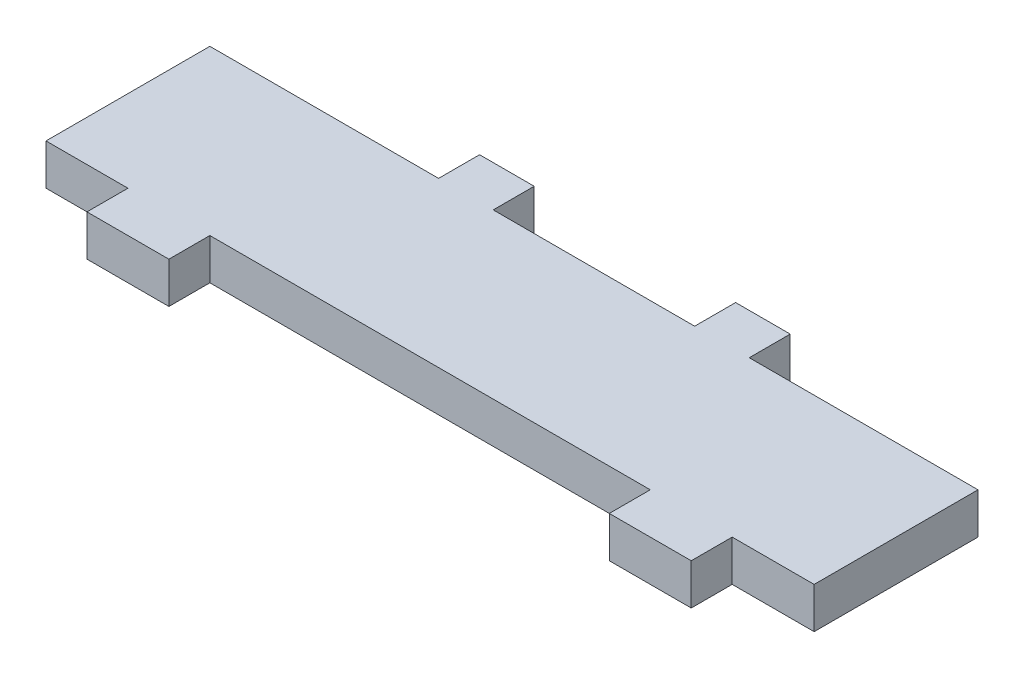
ISO-10303-21;
HEADER;
FILE_DESCRIPTION(('STEP AP214'),'2;1');
FILE_NAME('part.step','',(''),(''),'','','');
FILE_SCHEMA(('AUTOMOTIVE_DESIGN { 1 0 10303 214 1 1 1 1 }'));
ENDSEC;
DATA;
#1=APPLICATION_CONTEXT('core data for automotive mechanical design processes');
#2=APPLICATION_PROTOCOL_DEFINITION('international standard','automotive_design',2000,#1);
#3=PRODUCT_CONTEXT('',#1,'mechanical');
#4=PRODUCT('Part','Part','',(#3));
#5=PRODUCT_RELATED_PRODUCT_CATEGORY('part','',(#4));
#6=PRODUCT_DEFINITION_FORMATION('','',#4);
#7=PRODUCT_DEFINITION_CONTEXT('part definition',#1,'design');
#8=PRODUCT_DEFINITION('design','',#6,#7);
#9=PRODUCT_DEFINITION_SHAPE('','',#8);
#10=(LENGTH_UNIT() NAMED_UNIT(*) SI_UNIT(.MILLI.,.METRE.));
#11=(NAMED_UNIT(*) PLANE_ANGLE_UNIT() SI_UNIT($,.RADIAN.));
#12=(NAMED_UNIT(*) SI_UNIT($,.STERADIAN.) SOLID_ANGLE_UNIT());
#13=UNCERTAINTY_MEASURE_WITH_UNIT(LENGTH_MEASURE(1.E-05),#10,'distance_accuracy_value','');
#14=(GEOMETRIC_REPRESENTATION_CONTEXT(3) GLOBAL_UNCERTAINTY_ASSIGNED_CONTEXT((#13)) GLOBAL_UNIT_ASSIGNED_CONTEXT((#10,
#11,#12)) REPRESENTATION_CONTEXT('',''));
#15=CARTESIAN_POINT('',(0.,0.,0.));
#16=DIRECTION('',(0.,0.,1.));
#17=DIRECTION('',(1.,0.,0.));
#18=AXIS2_PLACEMENT_3D('',#15,#16,#17);
#19=CARTESIAN_POINT('',(-56.25,6.,12.));
#20=DIRECTION('',(0.,0.,-1.));
#21=DIRECTION('',(-1.,0.,0.));
#22=AXIS2_PLACEMENT_3D('',#19,#20,#21);
#23=PLANE('',#22);
#24=DIRECTION('',(0.,1.,0.));
#25=VECTOR('',#24,1.);
#26=CARTESIAN_POINT('',(44.25,0.,12.));
#27=LINE('',#26,#25);
#28=CARTESIAN_POINT('',(44.25,0.,12.));
#29=VERTEX_POINT('',#28);
#30=CARTESIAN_POINT('',(44.25,6.,12.));
#31=VERTEX_POINT('',#30);
#32=EDGE_CURVE('E353',#29,#31,#27,.T.);
#33=ORIENTED_EDGE('',*,*,#32,.F.);
#34=DIRECTION('',(1.,0.,0.));
#35=VECTOR('',#34,1.);
#36=CARTESIAN_POINT('',(-56.25,0.,12.));
#37=LINE('',#36,#35);
#38=CARTESIAN_POINT('',(56.25,0.,12.));
#39=VERTEX_POINT('',#38);
#40=EDGE_CURVE('E201',#29,#39,#37,.T.);
#41=ORIENTED_EDGE('',*,*,#40,.T.);
#42=DIRECTION('',(0.,-1.,0.));
#43=VECTOR('',#42,1.);
#44=CARTESIAN_POINT('',(56.25,6.,12.));
#45=LINE('',#44,#43);
#46=CARTESIAN_POINT('',(56.25,6.,12.));
#47=VERTEX_POINT('',#46);
#48=EDGE_CURVE('E301',#47,#39,#45,.T.);
#49=ORIENTED_EDGE('',*,*,#48,.F.);
#50=DIRECTION('',(1.,0.,0.));
#51=VECTOR('',#50,1.);
#52=CARTESIAN_POINT('',(-56.25,6.,12.));
#53=LINE('',#52,#51);
#54=EDGE_CURVE('E56',#31,#47,#53,.T.);
#55=ORIENTED_EDGE('',*,*,#54,.F.);
#56=EDGE_LOOP('',(#33,#41,#49,#55));
#57=FACE_BOUND('',#56,.T.);
#58=ADVANCED_FACE('F41',(#57),#23,.F.);
#59=CARTESIAN_POINT('',(-32.25,0.,12.));
#60=VERTEX_POINT('',#59);
#61=CARTESIAN_POINT('',(32.25,0.,12.));
#62=VERTEX_POINT('',#61);
#63=EDGE_CURVE('E312',#60,#62,#37,.T.);
#64=ORIENTED_EDGE('',*,*,#63,.T.);
#65=DIRECTION('',(0.,1.,0.));
#66=VECTOR('',#65,1.);
#67=CARTESIAN_POINT('',(32.25,0.,12.));
#68=LINE('',#67,#66);
#69=CARTESIAN_POINT('',(32.25,6.,12.));
#70=VERTEX_POINT('',#69);
#71=EDGE_CURVE('E64',#62,#70,#68,.T.);
#72=ORIENTED_EDGE('',*,*,#71,.T.);
#73=CARTESIAN_POINT('',(-32.25,6.,12.));
#74=VERTEX_POINT('',#73);
#75=EDGE_CURVE('E302',#74,#70,#53,.T.);
#76=ORIENTED_EDGE('',*,*,#75,.F.);
#77=DIRECTION('',(0.,1.,0.));
#78=VECTOR('',#77,1.);
#79=CARTESIAN_POINT('',(-32.25,0.,12.));
#80=LINE('',#79,#78);
#81=EDGE_CURVE('E204',#60,#74,#80,.T.);
#82=ORIENTED_EDGE('',*,*,#81,.F.);
#83=EDGE_LOOP('',(#64,#72,#76,#82));
#84=FACE_BOUND('',#83,.T.);
#85=ADVANCED_FACE('F350',(#84),#23,.F.);
#86=CARTESIAN_POINT('',(-56.25,6.,-12.));
#87=DIRECTION('',(0.,0.,1.));
#88=DIRECTION('',(1.,0.,0.));
#89=AXIS2_PLACEMENT_3D('',#86,#87,#88);
#90=PLANE('',#89);
#91=DIRECTION('',(0.,1.,0.));
#92=VECTOR('',#91,1.);
#93=CARTESIAN_POINT('',(-22.75,0.,-12.));
#94=LINE('',#93,#92);
#95=CARTESIAN_POINT('',(-22.75,0.,-12.));
#96=VERTEX_POINT('',#95);
#97=CARTESIAN_POINT('',(-22.75,6.,-12.));
#98=VERTEX_POINT('',#97);
#99=EDGE_CURVE('E238',#96,#98,#94,.T.);
#100=ORIENTED_EDGE('',*,*,#99,.F.);
#101=DIRECTION('',(-1.,0.,0.));
#102=VECTOR('',#101,1.);
#103=CARTESIAN_POINT('',(-56.25,0.,-12.));
#104=LINE('',#103,#102);
#105=CARTESIAN_POINT('',(-56.25,0.,-12.));
#106=VERTEX_POINT('',#105);
#107=EDGE_CURVE('E305',#96,#106,#104,.T.);
#108=ORIENTED_EDGE('',*,*,#107,.T.);
#109=DIRECTION('',(0.,-1.,0.));
#110=VECTOR('',#109,1.);
#111=CARTESIAN_POINT('',(-56.25,6.,-12.));
#112=LINE('',#111,#110);
#113=CARTESIAN_POINT('',(-56.25,6.,-12.));
#114=VERTEX_POINT('',#113);
#115=EDGE_CURVE('E49',#114,#106,#112,.T.);
#116=ORIENTED_EDGE('',*,*,#115,.F.);
#117=DIRECTION('',(-1.,0.,0.));
#118=VECTOR('',#117,1.);
#119=CARTESIAN_POINT('',(-56.25,6.,-12.));
#120=LINE('',#119,#118);
#121=EDGE_CURVE('E290',#98,#114,#120,.T.);
#122=ORIENTED_EDGE('',*,*,#121,.F.);
#123=EDGE_LOOP('',(#100,#108,#116,#122));
#124=FACE_BOUND('',#123,.T.);
#125=ADVANCED_FACE('F382',(#124),#90,.F.);
#126=DIRECTION('',(0.,-1.,0.));
#127=VECTOR('',#126,1.);
#128=CARTESIAN_POINT('',(22.75,0.,-12.));
#129=LINE('',#128,#127);
#130=CARTESIAN_POINT('',(22.75,6.,-12.));
#131=VERTEX_POINT('',#130);
#132=CARTESIAN_POINT('',(22.75,0.,-12.));
#133=VERTEX_POINT('',#132);
#134=EDGE_CURVE('E259',#131,#133,#129,.T.);
#135=ORIENTED_EDGE('',*,*,#134,.F.);
#136=CARTESIAN_POINT('',(56.25,6.,-12.));
#137=VERTEX_POINT('',#136);
#138=EDGE_CURVE('E292',#137,#131,#120,.T.);
#139=ORIENTED_EDGE('',*,*,#138,.F.);
#140=DIRECTION('',(0.,-1.,0.));
#141=VECTOR('',#140,1.);
#142=CARTESIAN_POINT('',(56.25,6.,-12.));
#143=LINE('',#142,#141);
#144=CARTESIAN_POINT('',(56.25,0.,-12.));
#145=VERTEX_POINT('',#144);
#146=EDGE_CURVE('E11',#137,#145,#143,.T.);
#147=ORIENTED_EDGE('',*,*,#146,.T.);
#148=EDGE_CURVE('E306',#145,#133,#104,.T.);
#149=ORIENTED_EDGE('',*,*,#148,.T.);
#150=EDGE_LOOP('',(#135,#139,#147,#149));
#151=FACE_BOUND('',#150,.T.);
#152=ADVANCED_FACE('F359',(#151),#90,.F.);
#153=CARTESIAN_POINT('',(56.25,6.,12.));
#154=DIRECTION('',(-1.,0.,0.));
#155=DIRECTION('',(0.,0.,1.));
#156=AXIS2_PLACEMENT_3D('',#153,#154,#155);
#157=PLANE('',#156);
#158=DIRECTION('',(0.,0.,-1.));
#159=VECTOR('',#158,1.);
#160=CARTESIAN_POINT('',(56.25,0.,12.));
#161=LINE('',#160,#159);
#162=EDGE_CURVE('E286',#39,#145,#161,.T.);
#163=ORIENTED_EDGE('',*,*,#162,.T.);
#164=ORIENTED_EDGE('',*,*,#146,.F.);
#165=DIRECTION('',(0.,0.,-1.));
#166=VECTOR('',#165,1.);
#167=CARTESIAN_POINT('',(56.25,6.,12.));
#168=LINE('',#167,#166);
#169=EDGE_CURVE('E287',#47,#137,#168,.T.);
#170=ORIENTED_EDGE('',*,*,#169,.F.);
#171=ORIENTED_EDGE('',*,*,#48,.T.);
#172=EDGE_LOOP('',(#163,#164,#170,#171));
#173=FACE_BOUND('',#172,.T.);
#174=ADVANCED_FACE('F43',(#173),#157,.F.);
#175=CARTESIAN_POINT('',(14.75,0.,-12.));
#176=VERTEX_POINT('',#175);
#177=CARTESIAN_POINT('',(-14.75,0.,-12.));
#178=VERTEX_POINT('',#177);
#179=EDGE_CURVE('E309',#176,#178,#104,.T.);
#180=ORIENTED_EDGE('',*,*,#179,.T.);
#181=DIRECTION('',(0.,1.,0.));
#182=VECTOR('',#181,1.);
#183=CARTESIAN_POINT('',(-14.75,0.,-12.));
#184=LINE('',#183,#182);
#185=CARTESIAN_POINT('',(-14.75,6.,-12.));
#186=VERTEX_POINT('',#185);
#187=EDGE_CURVE('E233',#178,#186,#184,.T.);
#188=ORIENTED_EDGE('',*,*,#187,.T.);
#189=CARTESIAN_POINT('',(14.75,6.,-12.));
#190=VERTEX_POINT('',#189);
#191=EDGE_CURVE('E296',#190,#186,#120,.T.);
#192=ORIENTED_EDGE('',*,*,#191,.F.);
#193=DIRECTION('',(0.,-1.,0.));
#194=VECTOR('',#193,1.);
#195=CARTESIAN_POINT('',(14.75,0.,-12.));
#196=LINE('',#195,#194);
#197=EDGE_CURVE('E264',#190,#176,#196,.T.);
#198=ORIENTED_EDGE('',*,*,#197,.T.);
#199=EDGE_LOOP('',(#180,#188,#192,#198));
#200=FACE_BOUND('',#199,.T.);
#201=ADVANCED_FACE('F392',(#200),#90,.F.);
#202=CARTESIAN_POINT('',(-56.25,6.,12.));
#203=DIRECTION('',(1.,0.,0.));
#204=DIRECTION('',(0.,0.,-1.));
#205=AXIS2_PLACEMENT_3D('',#202,#203,#204);
#206=PLANE('',#205);
#207=DIRECTION('',(0.,0.,1.));
#208=VECTOR('',#207,1.);
#209=CARTESIAN_POINT('',(-56.25,0.,12.));
#210=LINE('',#209,#208);
#211=CARTESIAN_POINT('',(-56.25,0.,12.));
#212=VERTEX_POINT('',#211);
#213=EDGE_CURVE('E308',#106,#212,#210,.T.);
#214=ORIENTED_EDGE('',*,*,#213,.T.);
#215=DIRECTION('',(0.,-1.,0.));
#216=VECTOR('',#215,1.);
#217=CARTESIAN_POINT('',(-56.25,6.,12.));
#218=LINE('',#217,#216);
#219=CARTESIAN_POINT('',(-56.25,6.,12.));
#220=VERTEX_POINT('',#219);
#221=EDGE_CURVE('E315',#220,#212,#218,.T.);
#222=ORIENTED_EDGE('',*,*,#221,.F.);
#223=DIRECTION('',(0.,0.,1.));
#224=VECTOR('',#223,1.);
#225=CARTESIAN_POINT('',(-56.25,6.,12.));
#226=LINE('',#225,#224);
#227=EDGE_CURVE('E295',#114,#220,#226,.T.);
#228=ORIENTED_EDGE('',*,*,#227,.F.);
#229=ORIENTED_EDGE('',*,*,#115,.T.);
#230=EDGE_LOOP('',(#214,#222,#228,#229));
#231=FACE_BOUND('',#230,.T.);
#232=ADVANCED_FACE('F322',(#231),#206,.F.);
#233=CARTESIAN_POINT('',(-44.25,0.,12.));
#234=VERTEX_POINT('',#233);
#235=EDGE_CURVE('E291',#212,#234,#37,.T.);
#236=ORIENTED_EDGE('',*,*,#235,.T.);
#237=DIRECTION('',(0.,1.,0.));
#238=VECTOR('',#237,1.);
#239=CARTESIAN_POINT('',(-44.25,0.,12.));
#240=LINE('',#239,#238);
#241=CARTESIAN_POINT('',(-44.25,6.,12.));
#242=VERTEX_POINT('',#241);
#243=EDGE_CURVE('E202',#234,#242,#240,.T.);
#244=ORIENTED_EDGE('',*,*,#243,.T.);
#245=EDGE_CURVE('E298',#220,#242,#53,.T.);
#246=ORIENTED_EDGE('',*,*,#245,.F.);
#247=ORIENTED_EDGE('',*,*,#221,.T.);
#248=EDGE_LOOP('',(#236,#244,#246,#247));
#249=FACE_BOUND('',#248,.T.);
#250=ADVANCED_FACE('F331',(#249),#23,.F.);
#251=CARTESIAN_POINT('',(0.,6.,0.));
#252=DIRECTION('',(0.,-1.,0.));
#253=DIRECTION('',(0.,0.,-1.));
#254=AXIS2_PLACEMENT_3D('',#251,#252,#253);
#255=PLANE('',#254);
#256=ORIENTED_EDGE('',*,*,#169,.T.);
#257=ORIENTED_EDGE('',*,*,#138,.T.);
#258=DIRECTION('',(0.,0.,1.));
#259=VECTOR('',#258,1.);
#260=CARTESIAN_POINT('',(22.75,6.,-18.));
#261=LINE('',#260,#259);
#262=CARTESIAN_POINT('',(22.75,6.,-18.));
#263=VERTEX_POINT('',#262);
#264=EDGE_CURVE('E283',#263,#131,#261,.T.);
#265=ORIENTED_EDGE('',*,*,#264,.F.);
#266=DIRECTION('',(1.,0.,0.));
#267=VECTOR('',#266,1.);
#268=CARTESIAN_POINT('',(0.,6.,-18.));
#269=LINE('',#268,#267);
#270=CARTESIAN_POINT('',(14.75,6.,-18.));
#271=VERTEX_POINT('',#270);
#272=EDGE_CURVE('E260',#271,#263,#269,.T.);
#273=ORIENTED_EDGE('',*,*,#272,.F.);
#274=DIRECTION('',(0.,0.,1.));
#275=VECTOR('',#274,1.);
#276=CARTESIAN_POINT('',(14.75,6.,-18.));
#277=LINE('',#276,#275);
#278=EDGE_CURVE('E271',#271,#190,#277,.T.);
#279=ORIENTED_EDGE('',*,*,#278,.T.);
#280=ORIENTED_EDGE('',*,*,#191,.T.);
#281=DIRECTION('',(0.,0.,1.));
#282=VECTOR('',#281,1.);
#283=CARTESIAN_POINT('',(-14.75,6.,-18.));
#284=LINE('',#283,#282);
#285=CARTESIAN_POINT('',(-14.75,6.,-18.));
#286=VERTEX_POINT('',#285);
#287=EDGE_CURVE('E244',#286,#186,#284,.T.);
#288=ORIENTED_EDGE('',*,*,#287,.F.);
#289=DIRECTION('',(1.,0.,0.));
#290=VECTOR('',#289,1.);
#291=CARTESIAN_POINT('',(0.,6.,-18.));
#292=LINE('',#291,#290);
#293=CARTESIAN_POINT('',(-22.75,6.,-18.));
#294=VERTEX_POINT('',#293);
#295=EDGE_CURVE('E242',#294,#286,#292,.T.);
#296=ORIENTED_EDGE('',*,*,#295,.F.);
#297=DIRECTION('',(0.,0.,1.));
#298=VECTOR('',#297,1.);
#299=CARTESIAN_POINT('',(-22.75,6.,-18.));
#300=LINE('',#299,#298);
#301=EDGE_CURVE('E250',#294,#98,#300,.T.);
#302=ORIENTED_EDGE('',*,*,#301,.T.);
#303=ORIENTED_EDGE('',*,*,#121,.T.);
#304=ORIENTED_EDGE('',*,*,#227,.T.);
#305=ORIENTED_EDGE('',*,*,#245,.T.);
#306=DIRECTION('',(0.,0.,-1.));
#307=VECTOR('',#306,1.);
#308=CARTESIAN_POINT('',(-44.25,6.,18.));
#309=LINE('',#308,#307);
#310=CARTESIAN_POINT('',(-44.25,6.,18.));
#311=VERTEX_POINT('',#310);
#312=EDGE_CURVE('E218',#311,#242,#309,.T.);
#313=ORIENTED_EDGE('',*,*,#312,.F.);
#314=DIRECTION('',(-1.,0.,0.));
#315=VECTOR('',#314,1.);
#316=CARTESIAN_POINT('',(0.,6.,18.));
#317=LINE('',#316,#315);
#318=CARTESIAN_POINT('',(-32.25,6.,18.));
#319=VERTEX_POINT('',#318);
#320=EDGE_CURVE('E217',#319,#311,#317,.T.);
#321=ORIENTED_EDGE('',*,*,#320,.F.);
#322=DIRECTION('',(0.,0.,-1.));
#323=VECTOR('',#322,1.);
#324=CARTESIAN_POINT('',(-32.25,6.,18.));
#325=LINE('',#324,#323);
#326=EDGE_CURVE('E224',#319,#74,#325,.T.);
#327=ORIENTED_EDGE('',*,*,#326,.T.);
#328=ORIENTED_EDGE('',*,*,#75,.T.);
#329=DIRECTION('',(0.,0.,-1.));
#330=VECTOR('',#329,1.);
#331=CARTESIAN_POINT('',(32.25,6.,18.));
#332=LINE('',#331,#330);
#333=CARTESIAN_POINT('',(32.25,6.,18.));
#334=VERTEX_POINT('',#333);
#335=EDGE_CURVE('E206',#334,#70,#332,.T.);
#336=ORIENTED_EDGE('',*,*,#335,.F.);
#337=DIRECTION('',(-1.,0.,0.));
#338=VECTOR('',#337,1.);
#339=CARTESIAN_POINT('',(0.,6.,18.));
#340=LINE('',#339,#338);
#341=CARTESIAN_POINT('',(44.25,6.,18.));
#342=VERTEX_POINT('',#341);
#343=EDGE_CURVE('E188',#342,#334,#340,.T.);
#344=ORIENTED_EDGE('',*,*,#343,.F.);
#345=DIRECTION('',(0.,0.,-1.));
#346=VECTOR('',#345,1.);
#347=CARTESIAN_POINT('',(44.25,6.,18.));
#348=LINE('',#347,#346);
#349=EDGE_CURVE('E185',#342,#31,#348,.T.);
#350=ORIENTED_EDGE('',*,*,#349,.T.);
#351=ORIENTED_EDGE('',*,*,#54,.T.);
#352=EDGE_LOOP('',(#256,#257,#265,#273,#279,#280,#288,#296,#302,#303,#304,#305,#313,#321,#327,
#328,#336,#344,#350,#351));
#353=FACE_BOUND('',#352,.T.);
#354=ADVANCED_FACE('F335',(#353),#255,.F.);
#355=CARTESIAN_POINT('',(0.,0.,0.));
#356=DIRECTION('',(0.,-1.,0.));
#357=DIRECTION('',(0.,0.,-1.));
#358=AXIS2_PLACEMENT_3D('',#355,#356,#357);
#359=PLANE('',#358);
#360=ORIENTED_EDGE('',*,*,#162,.F.);
#361=ORIENTED_EDGE('',*,*,#40,.F.);
#362=DIRECTION('',(0.,0.,-1.));
#363=VECTOR('',#362,1.);
#364=CARTESIAN_POINT('',(44.25,0.,18.));
#365=LINE('',#364,#363);
#366=CARTESIAN_POINT('',(44.25,0.,18.));
#367=VERTEX_POINT('',#366);
#368=EDGE_CURVE('E183',#367,#29,#365,.T.);
#369=ORIENTED_EDGE('',*,*,#368,.F.);
#370=DIRECTION('',(1.,0.,0.));
#371=VECTOR('',#370,1.);
#372=CARTESIAN_POINT('',(0.,0.,18.));
#373=LINE('',#372,#371);
#374=CARTESIAN_POINT('',(32.25,0.,18.));
#375=VERTEX_POINT('',#374);
#376=EDGE_CURVE('E189',#375,#367,#373,.T.);
#377=ORIENTED_EDGE('',*,*,#376,.F.);
#378=DIRECTION('',(0.,0.,-1.));
#379=VECTOR('',#378,1.);
#380=CARTESIAN_POINT('',(32.25,0.,18.));
#381=LINE('',#380,#379);
#382=EDGE_CURVE('E351',#375,#62,#381,.T.);
#383=ORIENTED_EDGE('',*,*,#382,.T.);
#384=ORIENTED_EDGE('',*,*,#63,.F.);
#385=DIRECTION('',(0.,0.,-1.));
#386=VECTOR('',#385,1.);
#387=CARTESIAN_POINT('',(-32.25,0.,18.));
#388=LINE('',#387,#386);
#389=CARTESIAN_POINT('',(-32.25,0.,18.));
#390=VERTEX_POINT('',#389);
#391=EDGE_CURVE('E227',#390,#60,#388,.T.);
#392=ORIENTED_EDGE('',*,*,#391,.F.);
#393=DIRECTION('',(1.,0.,0.));
#394=VECTOR('',#393,1.);
#395=CARTESIAN_POINT('',(0.,0.,18.));
#396=LINE('',#395,#394);
#397=CARTESIAN_POINT('',(-44.25,0.,18.));
#398=VERTEX_POINT('',#397);
#399=EDGE_CURVE('E213',#398,#390,#396,.T.);
#400=ORIENTED_EDGE('',*,*,#399,.F.);
#401=DIRECTION('',(0.,0.,-1.));
#402=VECTOR('',#401,1.);
#403=CARTESIAN_POINT('',(-44.25,0.,18.));
#404=LINE('',#403,#402);
#405=EDGE_CURVE('E230',#398,#234,#404,.T.);
#406=ORIENTED_EDGE('',*,*,#405,.T.);
#407=ORIENTED_EDGE('',*,*,#235,.F.);
#408=ORIENTED_EDGE('',*,*,#213,.F.);
#409=ORIENTED_EDGE('',*,*,#107,.F.);
#410=DIRECTION('',(0.,0.,1.));
#411=VECTOR('',#410,1.);
#412=CARTESIAN_POINT('',(-22.75,0.,-18.));
#413=LINE('',#412,#411);
#414=CARTESIAN_POINT('',(-22.75,0.,-18.));
#415=VERTEX_POINT('',#414);
#416=EDGE_CURVE('E253',#415,#96,#413,.T.);
#417=ORIENTED_EDGE('',*,*,#416,.F.);
#418=DIRECTION('',(-1.,0.,0.));
#419=VECTOR('',#418,1.);
#420=CARTESIAN_POINT('',(0.,0.,-18.));
#421=LINE('',#420,#419);
#422=CARTESIAN_POINT('',(-14.75,0.,-18.));
#423=VERTEX_POINT('',#422);
#424=EDGE_CURVE('E237',#423,#415,#421,.T.);
#425=ORIENTED_EDGE('',*,*,#424,.F.);
#426=DIRECTION('',(0.,0.,1.));
#427=VECTOR('',#426,1.);
#428=CARTESIAN_POINT('',(-14.75,0.,-18.));
#429=LINE('',#428,#427);
#430=EDGE_CURVE('E256',#423,#178,#429,.T.);
#431=ORIENTED_EDGE('',*,*,#430,.T.);
#432=ORIENTED_EDGE('',*,*,#179,.F.);
#433=DIRECTION('',(0.,0.,1.));
#434=VECTOR('',#433,1.);
#435=CARTESIAN_POINT('',(14.75,0.,-18.));
#436=LINE('',#435,#434);
#437=CARTESIAN_POINT('',(14.75,0.,-18.));
#438=VERTEX_POINT('',#437);
#439=EDGE_CURVE('E277',#438,#176,#436,.T.);
#440=ORIENTED_EDGE('',*,*,#439,.F.);
#441=DIRECTION('',(-1.,0.,0.));
#442=VECTOR('',#441,1.);
#443=CARTESIAN_POINT('',(0.,0.,-18.));
#444=LINE('',#443,#442);
#445=CARTESIAN_POINT('',(22.75,0.,-18.));
#446=VERTEX_POINT('',#445);
#447=EDGE_CURVE('E266',#446,#438,#444,.T.);
#448=ORIENTED_EDGE('',*,*,#447,.F.);
#449=DIRECTION('',(0.,0.,1.));
#450=VECTOR('',#449,1.);
#451=CARTESIAN_POINT('',(22.75,0.,-18.));
#452=LINE('',#451,#450);
#453=EDGE_CURVE('E280',#446,#133,#452,.T.);
#454=ORIENTED_EDGE('',*,*,#453,.T.);
#455=ORIENTED_EDGE('',*,*,#148,.F.);
#456=EDGE_LOOP('',(#360,#361,#369,#377,#383,#384,#392,#400,#406,#407,#408,#409,#417,#425,#431,
#432,#440,#448,#454,#455));
#457=FACE_BOUND('',#456,.T.);
#458=ADVANCED_FACE('F200',(#457),#359,.T.);
#459=CARTESIAN_POINT('',(22.75,0.,-18.));
#460=DIRECTION('',(-1.,0.,0.));
#461=DIRECTION('',(0.,0.,1.));
#462=AXIS2_PLACEMENT_3D('',#459,#460,#461);
#463=PLANE('',#462);
#464=ORIENTED_EDGE('',*,*,#134,.T.);
#465=ORIENTED_EDGE('',*,*,#453,.F.);
#466=DIRECTION('',(0.,-1.,0.));
#467=VECTOR('',#466,1.);
#468=CARTESIAN_POINT('',(22.75,0.,-18.));
#469=LINE('',#468,#467);
#470=EDGE_CURVE('E263',#263,#446,#469,.T.);
#471=ORIENTED_EDGE('',*,*,#470,.F.);
#472=ORIENTED_EDGE('',*,*,#264,.T.);
#473=EDGE_LOOP('',(#464,#465,#471,#472));
#474=FACE_BOUND('',#473,.T.);
#475=ADVANCED_FACE('F443',(#474),#463,.F.);
#476=CARTESIAN_POINT('',(14.75,0.,-18.));
#477=DIRECTION('',(-1.,0.,0.));
#478=DIRECTION('',(0.,0.,1.));
#479=AXIS2_PLACEMENT_3D('',#476,#477,#478);
#480=PLANE('',#479);
#481=ORIENTED_EDGE('',*,*,#197,.F.);
#482=ORIENTED_EDGE('',*,*,#278,.F.);
#483=DIRECTION('',(0.,-1.,0.));
#484=VECTOR('',#483,1.);
#485=CARTESIAN_POINT('',(14.75,0.,-18.));
#486=LINE('',#485,#484);
#487=EDGE_CURVE('E268',#271,#438,#486,.T.);
#488=ORIENTED_EDGE('',*,*,#487,.T.);
#489=ORIENTED_EDGE('',*,*,#439,.T.);
#490=EDGE_LOOP('',(#481,#482,#488,#489));
#491=FACE_BOUND('',#490,.T.);
#492=ADVANCED_FACE('F574',(#491),#480,.T.);
#493=CARTESIAN_POINT('',(0.,0.,-18.));
#494=DIRECTION('',(0.,0.,-1.));
#495=DIRECTION('',(-1.,0.,0.));
#496=AXIS2_PLACEMENT_3D('',#493,#494,#495);
#497=PLANE('',#496);
#498=ORIENTED_EDGE('',*,*,#272,.T.);
#499=ORIENTED_EDGE('',*,*,#470,.T.);
#500=ORIENTED_EDGE('',*,*,#447,.T.);
#501=ORIENTED_EDGE('',*,*,#487,.F.);
#502=EDGE_LOOP('',(#498,#499,#500,#501));
#503=FACE_BOUND('',#502,.T.);
#504=ADVANCED_FACE('F566',(#503),#497,.T.);
#505=CARTESIAN_POINT('',(-14.75,0.,-18.));
#506=DIRECTION('',(1.,0.,0.));
#507=DIRECTION('',(0.,0.,-1.));
#508=AXIS2_PLACEMENT_3D('',#505,#506,#507);
#509=PLANE('',#508);
#510=ORIENTED_EDGE('',*,*,#187,.F.);
#511=ORIENTED_EDGE('',*,*,#430,.F.);
#512=DIRECTION('',(0.,1.,0.));
#513=VECTOR('',#512,1.);
#514=CARTESIAN_POINT('',(-14.75,0.,-18.));
#515=LINE('',#514,#513);
#516=EDGE_CURVE('E234',#423,#286,#515,.T.);
#517=ORIENTED_EDGE('',*,*,#516,.T.);
#518=ORIENTED_EDGE('',*,*,#287,.T.);
#519=EDGE_LOOP('',(#510,#511,#517,#518));
#520=FACE_BOUND('',#519,.T.);
#521=ADVANCED_FACE('F558',(#520),#509,.T.);
#522=CARTESIAN_POINT('',(-22.75,0.,-18.));
#523=DIRECTION('',(1.,0.,0.));
#524=DIRECTION('',(0.,1.,0.));
#525=AXIS2_PLACEMENT_3D('',#522,#523,#524);
#526=PLANE('',#525);
#527=ORIENTED_EDGE('',*,*,#99,.T.);
#528=ORIENTED_EDGE('',*,*,#301,.F.);
#529=DIRECTION('',(0.,1.,0.));
#530=VECTOR('',#529,1.);
#531=CARTESIAN_POINT('',(-22.75,0.,-18.));
#532=LINE('',#531,#530);
#533=EDGE_CURVE('E240',#415,#294,#532,.T.);
#534=ORIENTED_EDGE('',*,*,#533,.F.);
#535=ORIENTED_EDGE('',*,*,#416,.T.);
#536=EDGE_LOOP('',(#527,#528,#534,#535));
#537=FACE_BOUND('',#536,.T.);
#538=ADVANCED_FACE('F551',(#537),#526,.F.);
#539=CARTESIAN_POINT('',(0.,0.,-18.));
#540=DIRECTION('',(0.,0.,-1.));
#541=DIRECTION('',(-1.,0.,0.));
#542=AXIS2_PLACEMENT_3D('',#539,#540,#541);
#543=PLANE('',#542);
#544=ORIENTED_EDGE('',*,*,#516,.F.);
#545=ORIENTED_EDGE('',*,*,#424,.T.);
#546=ORIENTED_EDGE('',*,*,#533,.T.);
#547=ORIENTED_EDGE('',*,*,#295,.T.);
#548=EDGE_LOOP('',(#544,#545,#546,#547));
#549=FACE_BOUND('',#548,.T.);
#550=ADVANCED_FACE('F478',(#549),#543,.T.);
#551=CARTESIAN_POINT('',(-44.25,0.,18.));
#552=DIRECTION('',(-1.,0.,0.));
#553=DIRECTION('',(0.,0.,1.));
#554=AXIS2_PLACEMENT_3D('',#551,#552,#553);
#555=PLANE('',#554);
#556=ORIENTED_EDGE('',*,*,#243,.F.);
#557=ORIENTED_EDGE('',*,*,#405,.F.);
#558=DIRECTION('',(0.,1.,0.));
#559=VECTOR('',#558,1.);
#560=CARTESIAN_POINT('',(-44.25,0.,18.));
#561=LINE('',#560,#559);
#562=EDGE_CURVE('E210',#398,#311,#561,.T.);
#563=ORIENTED_EDGE('',*,*,#562,.T.);
#564=ORIENTED_EDGE('',*,*,#312,.T.);
#565=EDGE_LOOP('',(#556,#557,#563,#564));
#566=FACE_BOUND('',#565,.T.);
#567=ADVANCED_FACE('F338',(#566),#555,.T.);
#568=CARTESIAN_POINT('',(-32.25,0.,18.));
#569=DIRECTION('',(-1.,0.,0.));
#570=DIRECTION('',(0.,0.,1.));
#571=AXIS2_PLACEMENT_3D('',#568,#569,#570);
#572=PLANE('',#571);
#573=ORIENTED_EDGE('',*,*,#81,.T.);
#574=ORIENTED_EDGE('',*,*,#326,.F.);
#575=DIRECTION('',(0.,1.,0.));
#576=VECTOR('',#575,1.);
#577=CARTESIAN_POINT('',(-32.25,0.,18.));
#578=LINE('',#577,#576);
#579=EDGE_CURVE('E215',#390,#319,#578,.T.);
#580=ORIENTED_EDGE('',*,*,#579,.F.);
#581=ORIENTED_EDGE('',*,*,#391,.T.);
#582=EDGE_LOOP('',(#573,#574,#580,#581));
#583=FACE_BOUND('',#582,.T.);
#584=ADVANCED_FACE('F348',(#583),#572,.F.);
#585=CARTESIAN_POINT('',(0.,0.,18.));
#586=DIRECTION('',(0.,0.,1.));
#587=DIRECTION('',(1.,0.,0.));
#588=AXIS2_PLACEMENT_3D('',#585,#586,#587);
#589=PLANE('',#588);
#590=ORIENTED_EDGE('',*,*,#562,.F.);
#591=ORIENTED_EDGE('',*,*,#399,.T.);
#592=ORIENTED_EDGE('',*,*,#579,.T.);
#593=ORIENTED_EDGE('',*,*,#320,.T.);
#594=EDGE_LOOP('',(#590,#591,#592,#593));
#595=FACE_BOUND('',#594,.T.);
#596=ADVANCED_FACE('F341',(#595),#589,.T.);
#597=CARTESIAN_POINT('',(44.25,0.,18.));
#598=DIRECTION('',(-1.,0.,0.));
#599=DIRECTION('',(0.,0.,1.));
#600=AXIS2_PLACEMENT_3D('',#597,#598,#599);
#601=PLANE('',#600);
#602=ORIENTED_EDGE('',*,*,#32,.T.);
#603=ORIENTED_EDGE('',*,*,#349,.F.);
#604=DIRECTION('',(0.,1.,0.));
#605=VECTOR('',#604,1.);
#606=CARTESIAN_POINT('',(44.25,0.,18.));
#607=LINE('',#606,#605);
#608=EDGE_CURVE('E179',#367,#342,#607,.T.);
#609=ORIENTED_EDGE('',*,*,#608,.F.);
#610=ORIENTED_EDGE('',*,*,#368,.T.);
#611=EDGE_LOOP('',(#602,#603,#609,#610));
#612=FACE_BOUND('',#611,.T.);
#613=ADVANCED_FACE('F181',(#612),#601,.F.);
#614=CARTESIAN_POINT('',(32.25,0.,18.));
#615=DIRECTION('',(-1.,0.,0.));
#616=DIRECTION('',(0.,0.,1.));
#617=AXIS2_PLACEMENT_3D('',#614,#615,#616);
#618=PLANE('',#617);
#619=ORIENTED_EDGE('',*,*,#71,.F.);
#620=ORIENTED_EDGE('',*,*,#382,.F.);
#621=DIRECTION('',(0.,1.,0.));
#622=VECTOR('',#621,1.);
#623=CARTESIAN_POINT('',(32.25,0.,18.));
#624=LINE('',#623,#622);
#625=EDGE_CURVE('E195',#375,#334,#624,.T.);
#626=ORIENTED_EDGE('',*,*,#625,.T.);
#627=ORIENTED_EDGE('',*,*,#335,.T.);
#628=EDGE_LOOP('',(#619,#620,#626,#627));
#629=FACE_BOUND('',#628,.T.);
#630=ADVANCED_FACE('F367',(#629),#618,.T.);
#631=CARTESIAN_POINT('',(0.,0.,18.));
#632=DIRECTION('',(0.,0.,1.));
#633=DIRECTION('',(1.,0.,0.));
#634=AXIS2_PLACEMENT_3D('',#631,#632,#633);
#635=PLANE('',#634);
#636=ORIENTED_EDGE('',*,*,#376,.T.);
#637=ORIENTED_EDGE('',*,*,#608,.T.);
#638=ORIENTED_EDGE('',*,*,#343,.T.);
#639=ORIENTED_EDGE('',*,*,#625,.F.);
#640=EDGE_LOOP('',(#636,#637,#638,#639));
#641=FACE_BOUND('',#640,.T.);
#642=ADVANCED_FACE('F193',(#641),#635,.T.);
#643=CLOSED_SHELL('',(#58,#85,#125,#152,#174,#201,#232,#250,#354,#458,#475,#492,#504,#521,#538,
#550,#567,#584,#596,#613,#630,#642));
#644=MANIFOLD_SOLID_BREP('B2',#643);
#645=ADVANCED_BREP_SHAPE_REPRESENTATION('',(#18,#644),#14);
#646=SHAPE_DEFINITION_REPRESENTATION(#9,#645);
ENDSEC;
END-ISO-10303-21;
